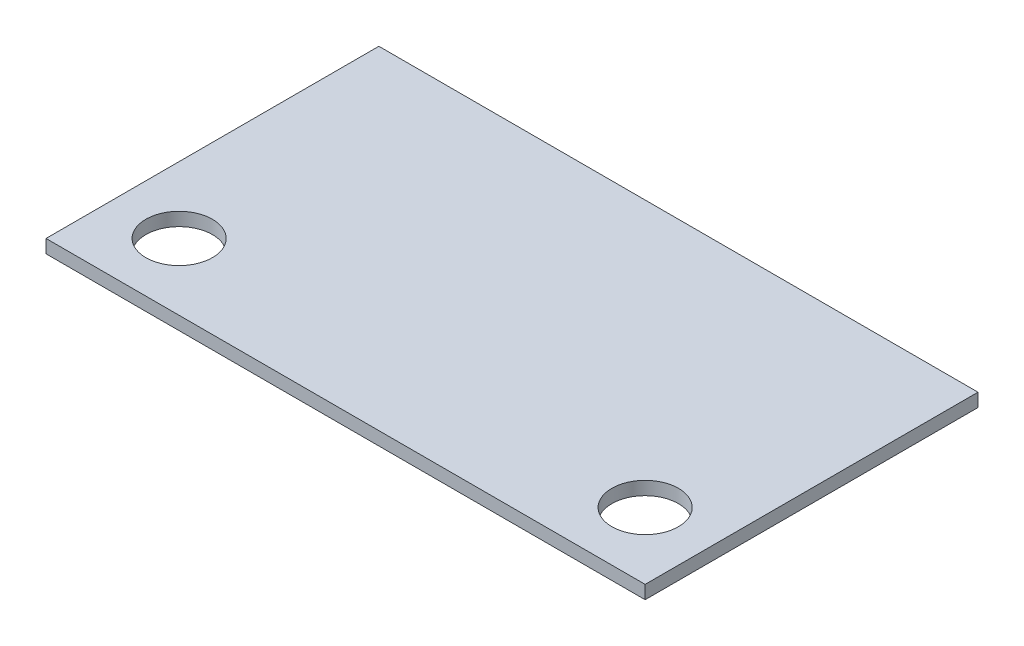
ISO-10303-21;
HEADER;
FILE_DESCRIPTION(('STEP AP214'),'2;1');
FILE_NAME('part.step','',(''),(''),'','','');
FILE_SCHEMA(('AUTOMOTIVE_DESIGN { 1 0 10303 214 1 1 1 1 }'));
ENDSEC;
DATA;
#1=APPLICATION_CONTEXT('core data for automotive mechanical design processes');
#2=APPLICATION_PROTOCOL_DEFINITION('international standard','automotive_design',2000,#1);
#3=PRODUCT_CONTEXT('',#1,'mechanical');
#4=PRODUCT('Part','Part','',(#3));
#5=PRODUCT_RELATED_PRODUCT_CATEGORY('part','',(#4));
#6=PRODUCT_DEFINITION_FORMATION('','',#4);
#7=PRODUCT_DEFINITION_CONTEXT('part definition',#1,'design');
#8=PRODUCT_DEFINITION('design','',#6,#7);
#9=PRODUCT_DEFINITION_SHAPE('','',#8);
#10=(LENGTH_UNIT() NAMED_UNIT(*) SI_UNIT(.MILLI.,.METRE.));
#11=(NAMED_UNIT(*) PLANE_ANGLE_UNIT() SI_UNIT($,.RADIAN.));
#12=(NAMED_UNIT(*) SI_UNIT($,.STERADIAN.) SOLID_ANGLE_UNIT());
#13=UNCERTAINTY_MEASURE_WITH_UNIT(LENGTH_MEASURE(1.E-05),#10,'distance_accuracy_value','');
#14=(GEOMETRIC_REPRESENTATION_CONTEXT(3) GLOBAL_UNCERTAINTY_ASSIGNED_CONTEXT((#13)) GLOBAL_UNIT_ASSIGNED_CONTEXT((#10,
#11,#12)) REPRESENTATION_CONTEXT('',''));
#15=CARTESIAN_POINT('',(0.,0.,0.));
#16=DIRECTION('',(0.,0.,1.));
#17=DIRECTION('',(1.,0.,0.));
#18=AXIS2_PLACEMENT_3D('',#15,#16,#17);
#19=CARTESIAN_POINT('',(0.,2.,0.));
#20=DIRECTION('',(0.,1.,0.));
#21=DIRECTION('',(0.,0.,1.));
#22=AXIS2_PLACEMENT_3D('',#19,#20,#21);
#23=PLANE('',#22);
#24=CARTESIAN_POINT('',(-27.5396825396825,2.,21.031746031746));
#25=DIRECTION('',(0.,1.,0.));
#26=DIRECTION('',(0.,0.,1.));
#27=AXIS2_PLACEMENT_3D('',#24,#25,#26);
#28=CIRCLE('',#27,5.);
#29=CARTESIAN_POINT('',(-27.5396825396825,2.,26.031746031746));
#30=VERTEX_POINT('',#29);
#31=EDGE_CURVE('E112',#30,#30,#28,.T.);
#32=ORIENTED_EDGE('',*,*,#31,.F.);
#33=EDGE_LOOP('',(#32));
#34=FACE_BOUND('',#33,.T.);
#35=DIRECTION('',(0.,0.,1.));
#36=VECTOR('',#35,1.);
#37=CARTESIAN_POINT('',(-37.5396825396826,2.,-18.968253968254));
#38=LINE('',#37,#36);
#39=CARTESIAN_POINT('',(-37.5396825396826,2.,-18.968253968254));
#40=VERTEX_POINT('',#39);
#41=CARTESIAN_POINT('',(-37.5396825396825,2.,31.031746031746));
#42=VERTEX_POINT('',#41);
#43=EDGE_CURVE('E92',#40,#42,#38,.T.);
#44=ORIENTED_EDGE('',*,*,#43,.T.);
#45=DIRECTION('',(1.,0.,0.));
#46=VECTOR('',#45,1.);
#47=CARTESIAN_POINT('',(-37.5396825396825,2.,31.031746031746));
#48=LINE('',#47,#46);
#49=CARTESIAN_POINT('',(52.4603174603174,2.,31.031746031746));
#50=VERTEX_POINT('',#49);
#51=EDGE_CURVE('E87',#42,#50,#48,.T.);
#52=ORIENTED_EDGE('',*,*,#51,.T.);
#53=DIRECTION('',(0.,0.,-1.));
#54=VECTOR('',#53,1.);
#55=CARTESIAN_POINT('',(52.4603174603174,2.,-18.968253968254));
#56=LINE('',#55,#54);
#57=CARTESIAN_POINT('',(52.4603174603174,2.,-18.968253968254));
#58=VERTEX_POINT('',#57);
#59=EDGE_CURVE('E90',#50,#58,#56,.T.);
#60=ORIENTED_EDGE('',*,*,#59,.T.);
#61=DIRECTION('',(-1.,0.,0.));
#62=VECTOR('',#61,1.);
#63=CARTESIAN_POINT('',(-37.5396825396826,2.,-18.968253968254));
#64=LINE('',#63,#62);
#65=EDGE_CURVE('E57',#58,#40,#64,.T.);
#66=ORIENTED_EDGE('',*,*,#65,.T.);
#67=EDGE_LOOP('',(#44,#52,#60,#66));
#68=FACE_BOUND('',#67,.T.);
#69=CARTESIAN_POINT('',(42.4603174603174,2.,21.031746031746));
#70=DIRECTION('',(0.,1.,0.));
#71=DIRECTION('',(0.,0.,1.));
#72=AXIS2_PLACEMENT_3D('',#69,#70,#71);
#73=CIRCLE('',#72,5.);
#74=CARTESIAN_POINT('',(42.4603174603174,2.,26.031746031746));
#75=VERTEX_POINT('',#74);
#76=EDGE_CURVE('E134',#75,#75,#73,.T.);
#77=ORIENTED_EDGE('',*,*,#76,.F.);
#78=EDGE_LOOP('',(#77));
#79=FACE_BOUND('',#78,.T.);
#80=ADVANCED_FACE('F39',(#34,#68,#79),#23,.T.);
#81=CARTESIAN_POINT('',(0.,0.,0.));
#82=DIRECTION('',(0.,1.,0.));
#83=DIRECTION('',(0.,0.,1.));
#84=AXIS2_PLACEMENT_3D('',#81,#82,#83);
#85=PLANE('',#84);
#86=DIRECTION('',(0.,0.,1.));
#87=VECTOR('',#86,1.);
#88=CARTESIAN_POINT('',(-37.5396825396826,0.,-18.968253968254));
#89=LINE('',#88,#87);
#90=CARTESIAN_POINT('',(-37.5396825396826,0.,-18.968253968254));
#91=VERTEX_POINT('',#90);
#92=CARTESIAN_POINT('',(-37.5396825396825,0.,31.031746031746));
#93=VERTEX_POINT('',#92);
#94=EDGE_CURVE('E108',#91,#93,#89,.T.);
#95=ORIENTED_EDGE('',*,*,#94,.F.);
#96=DIRECTION('',(-1.,0.,0.));
#97=VECTOR('',#96,1.);
#98=CARTESIAN_POINT('',(-37.5396825396826,0.,-18.968253968254));
#99=LINE('',#98,#97);
#100=CARTESIAN_POINT('',(52.4603174603174,0.,-18.968253968254));
#101=VERTEX_POINT('',#100);
#102=EDGE_CURVE('E80',#101,#91,#99,.T.);
#103=ORIENTED_EDGE('',*,*,#102,.F.);
#104=DIRECTION('',(0.,0.,-1.));
#105=VECTOR('',#104,1.);
#106=CARTESIAN_POINT('',(52.4603174603174,0.,-18.968253968254));
#107=LINE('',#106,#105);
#108=CARTESIAN_POINT('',(52.4603174603174,0.,31.031746031746));
#109=VERTEX_POINT('',#108);
#110=EDGE_CURVE('E74',#109,#101,#107,.T.);
#111=ORIENTED_EDGE('',*,*,#110,.F.);
#112=DIRECTION('',(1.,0.,0.));
#113=VECTOR('',#112,1.);
#114=CARTESIAN_POINT('',(-37.5396825396825,0.,31.031746031746));
#115=LINE('',#114,#113);
#116=EDGE_CURVE('E97',#93,#109,#115,.T.);
#117=ORIENTED_EDGE('',*,*,#116,.F.);
#118=EDGE_LOOP('',(#95,#103,#111,#117));
#119=FACE_BOUND('',#118,.T.);
#120=CARTESIAN_POINT('',(-27.5396825396825,0.,21.031746031746));
#121=DIRECTION('',(0.,1.,0.));
#122=DIRECTION('',(0.,0.,1.));
#123=AXIS2_PLACEMENT_3D('',#120,#121,#122);
#124=CIRCLE('',#123,5.);
#125=CARTESIAN_POINT('',(-27.5396825396825,0.,26.031746031746));
#126=VERTEX_POINT('',#125);
#127=EDGE_CURVE('E130',#126,#126,#124,.T.);
#128=ORIENTED_EDGE('',*,*,#127,.T.);
#129=EDGE_LOOP('',(#128));
#130=FACE_BOUND('',#129,.T.);
#131=CARTESIAN_POINT('',(42.4603174603174,0.,21.031746031746));
#132=DIRECTION('',(0.,1.,0.));
#133=DIRECTION('',(0.,0.,1.));
#134=AXIS2_PLACEMENT_3D('',#131,#132,#133);
#135=CIRCLE('',#134,5.);
#136=CARTESIAN_POINT('',(42.4603174603174,0.,26.031746031746));
#137=VERTEX_POINT('',#136);
#138=EDGE_CURVE('E138',#137,#137,#135,.T.);
#139=ORIENTED_EDGE('',*,*,#138,.T.);
#140=EDGE_LOOP('',(#139));
#141=FACE_BOUND('',#140,.T.);
#142=ADVANCED_FACE('F125',(#119,#130,#141),#85,.F.);
#143=CARTESIAN_POINT('',(-37.5396825396826,2.,-18.968253968254));
#144=DIRECTION('',(1.,0.,0.));
#145=DIRECTION('',(0.,0.,-1.));
#146=AXIS2_PLACEMENT_3D('',#143,#144,#145);
#147=PLANE('',#146);
#148=ORIENTED_EDGE('',*,*,#94,.T.);
#149=DIRECTION('',(0.,-1.,0.));
#150=VECTOR('',#149,1.);
#151=CARTESIAN_POINT('',(-37.5396825396825,2.,31.031746031746));
#152=LINE('',#151,#150);
#153=EDGE_CURVE('E11',#42,#93,#152,.T.);
#154=ORIENTED_EDGE('',*,*,#153,.F.);
#155=ORIENTED_EDGE('',*,*,#43,.F.);
#156=DIRECTION('',(0.,-1.,0.));
#157=VECTOR('',#156,1.);
#158=CARTESIAN_POINT('',(-37.5396825396826,2.,-18.968253968254));
#159=LINE('',#158,#157);
#160=EDGE_CURVE('E104',#40,#91,#159,.T.);
#161=ORIENTED_EDGE('',*,*,#160,.T.);
#162=EDGE_LOOP('',(#148,#154,#155,#161));
#163=FACE_BOUND('',#162,.T.);
#164=ADVANCED_FACE('F41',(#163),#147,.F.);
#165=CARTESIAN_POINT('',(-37.5396825396825,2.,31.031746031746));
#166=DIRECTION('',(0.,0.,-1.));
#167=DIRECTION('',(-1.,0.,0.));
#168=AXIS2_PLACEMENT_3D('',#165,#166,#167);
#169=PLANE('',#168);
#170=ORIENTED_EDGE('',*,*,#116,.T.);
#171=DIRECTION('',(0.,-1.,0.));
#172=VECTOR('',#171,1.);
#173=CARTESIAN_POINT('',(52.4603174603174,2.,31.031746031746));
#174=LINE('',#173,#172);
#175=EDGE_CURVE('E49',#50,#109,#174,.T.);
#176=ORIENTED_EDGE('',*,*,#175,.F.);
#177=ORIENTED_EDGE('',*,*,#51,.F.);
#178=ORIENTED_EDGE('',*,*,#153,.T.);
#179=EDGE_LOOP('',(#170,#176,#177,#178));
#180=FACE_BOUND('',#179,.T.);
#181=ADVANCED_FACE('F96',(#180),#169,.F.);
#182=CARTESIAN_POINT('',(52.4603174603174,2.,-18.968253968254));
#183=DIRECTION('',(-1.,0.,0.));
#184=DIRECTION('',(0.,0.,1.));
#185=AXIS2_PLACEMENT_3D('',#182,#183,#184);
#186=PLANE('',#185);
#187=ORIENTED_EDGE('',*,*,#110,.T.);
#188=DIRECTION('',(0.,-1.,0.));
#189=VECTOR('',#188,1.);
#190=CARTESIAN_POINT('',(52.4603174603174,2.,-18.968253968254));
#191=LINE('',#190,#189);
#192=EDGE_CURVE('E99',#58,#101,#191,.T.);
#193=ORIENTED_EDGE('',*,*,#192,.F.);
#194=ORIENTED_EDGE('',*,*,#59,.F.);
#195=ORIENTED_EDGE('',*,*,#175,.T.);
#196=EDGE_LOOP('',(#187,#193,#194,#195));
#197=FACE_BOUND('',#196,.T.);
#198=ADVANCED_FACE('F100',(#197),#186,.F.);
#199=CARTESIAN_POINT('',(-37.5396825396826,2.,-18.968253968254));
#200=DIRECTION('',(0.,0.,1.));
#201=DIRECTION('',(1.,0.,0.));
#202=AXIS2_PLACEMENT_3D('',#199,#200,#201);
#203=PLANE('',#202);
#204=ORIENTED_EDGE('',*,*,#102,.T.);
#205=ORIENTED_EDGE('',*,*,#160,.F.);
#206=ORIENTED_EDGE('',*,*,#65,.F.);
#207=ORIENTED_EDGE('',*,*,#192,.T.);
#208=EDGE_LOOP('',(#204,#205,#206,#207));
#209=FACE_BOUND('',#208,.T.);
#210=ADVANCED_FACE('F122',(#209),#203,.F.);
#211=CARTESIAN_POINT('',(-27.5396825396825,2.,21.031746031746));
#212=DIRECTION('',(0.,-1.,0.));
#213=DIRECTION('',(0.,0.,-1.));
#214=AXIS2_PLACEMENT_3D('',#211,#212,#213);
#215=CYLINDRICAL_SURFACE('',#214,5.);
#216=ORIENTED_EDGE('',*,*,#31,.T.);
#217=EDGE_LOOP('',(#216));
#218=FACE_BOUND('',#217,.T.);
#219=ORIENTED_EDGE('',*,*,#127,.F.);
#220=EDGE_LOOP('',(#219));
#221=FACE_BOUND('',#220,.T.);
#222=ADVANCED_FACE('F157',(#218,#221),#215,.F.);
#223=CARTESIAN_POINT('',(42.4603174603174,2.,21.031746031746));
#224=DIRECTION('',(0.,-1.,0.));
#225=DIRECTION('',(0.,0.,-1.));
#226=AXIS2_PLACEMENT_3D('',#223,#224,#225);
#227=CYLINDRICAL_SURFACE('',#226,5.);
#228=ORIENTED_EDGE('',*,*,#76,.T.);
#229=EDGE_LOOP('',(#228));
#230=FACE_BOUND('',#229,.T.);
#231=ORIENTED_EDGE('',*,*,#138,.F.);
#232=EDGE_LOOP('',(#231));
#233=FACE_BOUND('',#232,.T.);
#234=ADVANCED_FACE('F146',(#230,#233),#227,.F.);
#235=CLOSED_SHELL('',(#80,#142,#164,#181,#198,#210,#222,#234));
#236=MANIFOLD_SOLID_BREP('B2',#235);
#237=ADVANCED_BREP_SHAPE_REPRESENTATION('',(#18,#236),#14);
#238=SHAPE_DEFINITION_REPRESENTATION(#9,#237);
ENDSEC;
END-ISO-10303-21;
